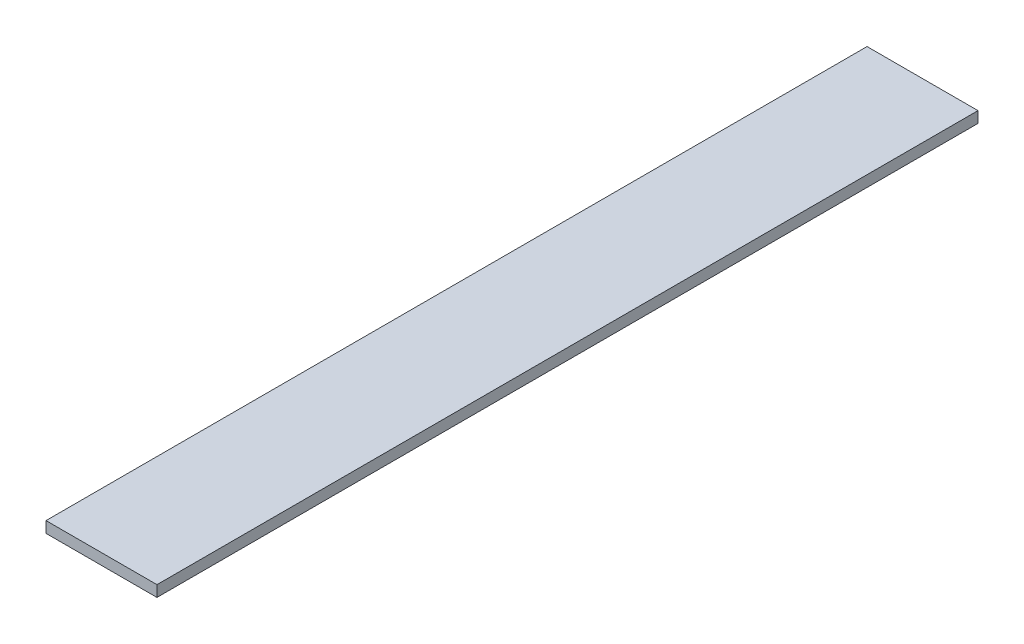
ISO-10303-21;
HEADER;
FILE_DESCRIPTION(('STEP AP214'),'2;1');
FILE_NAME('part.step','',(''),(''),'','','');
FILE_SCHEMA(('AUTOMOTIVE_DESIGN { 1 0 10303 214 1 1 1 1 }'));
ENDSEC;
DATA;
#1=APPLICATION_CONTEXT('core data for automotive mechanical design processes');
#2=APPLICATION_PROTOCOL_DEFINITION('international standard','automotive_design',2000,#1);
#3=PRODUCT_CONTEXT('',#1,'mechanical');
#4=PRODUCT('Part','Part','',(#3));
#5=PRODUCT_RELATED_PRODUCT_CATEGORY('part','',(#4));
#6=PRODUCT_DEFINITION_FORMATION('','',#4);
#7=PRODUCT_DEFINITION_CONTEXT('part definition',#1,'design');
#8=PRODUCT_DEFINITION('design','',#6,#7);
#9=PRODUCT_DEFINITION_SHAPE('','',#8);
#10=(LENGTH_UNIT() NAMED_UNIT(*) SI_UNIT(.MILLI.,.METRE.));
#11=(NAMED_UNIT(*) PLANE_ANGLE_UNIT() SI_UNIT($,.RADIAN.));
#12=(NAMED_UNIT(*) SI_UNIT($,.STERADIAN.) SOLID_ANGLE_UNIT());
#13=UNCERTAINTY_MEASURE_WITH_UNIT(LENGTH_MEASURE(1.E-05),#10,'distance_accuracy_value','');
#14=(GEOMETRIC_REPRESENTATION_CONTEXT(3) GLOBAL_UNCERTAINTY_ASSIGNED_CONTEXT((#13)) GLOBAL_UNIT_ASSIGNED_CONTEXT((#10,
#11,#12)) REPRESENTATION_CONTEXT('',''));
#15=CARTESIAN_POINT('',(0.,0.,0.));
#16=DIRECTION('',(0.,0.,1.));
#17=DIRECTION('',(1.,0.,0.));
#18=AXIS2_PLACEMENT_3D('',#15,#16,#17);
#19=CARTESIAN_POINT('',(0.,5.,-370.));
#20=DIRECTION('',(-1.,0.,0.));
#21=DIRECTION('',(0.,0.,1.));
#22=AXIS2_PLACEMENT_3D('',#19,#20,#21);
#23=PLANE('',#22);
#24=DIRECTION('',(0.,0.,-1.));
#25=VECTOR('',#24,1.);
#26=CARTESIAN_POINT('',(0.,0.,-370.));
#27=LINE('',#26,#25);
#28=CARTESIAN_POINT('',(0.,0.,0.));
#29=VERTEX_POINT('',#28);
#30=CARTESIAN_POINT('',(0.,0.,-370.));
#31=VERTEX_POINT('',#30);
#32=EDGE_CURVE('E107',#29,#31,#27,.T.);
#33=ORIENTED_EDGE('',*,*,#32,.T.);
#34=DIRECTION('',(0.,-1.,0.));
#35=VECTOR('',#34,1.);
#36=CARTESIAN_POINT('',(0.,5.,-370.));
#37=LINE('',#36,#35);
#38=CARTESIAN_POINT('',(0.,5.,-370.));
#39=VERTEX_POINT('',#38);
#40=EDGE_CURVE('E11',#39,#31,#37,.T.);
#41=ORIENTED_EDGE('',*,*,#40,.F.);
#42=DIRECTION('',(0.,0.,-1.));
#43=VECTOR('',#42,1.);
#44=CARTESIAN_POINT('',(0.,5.,-370.));
#45=LINE('',#44,#43);
#46=CARTESIAN_POINT('',(0.,5.,0.));
#47=VERTEX_POINT('',#46);
#48=EDGE_CURVE('E91',#47,#39,#45,.T.);
#49=ORIENTED_EDGE('',*,*,#48,.F.);
#50=DIRECTION('',(0.,-1.,0.));
#51=VECTOR('',#50,1.);
#52=CARTESIAN_POINT('',(0.,5.,0.));
#53=LINE('',#52,#51);
#54=EDGE_CURVE('E103',#47,#29,#53,.T.);
#55=ORIENTED_EDGE('',*,*,#54,.T.);
#56=EDGE_LOOP('',(#33,#41,#49,#55));
#57=FACE_BOUND('',#56,.T.);
#58=ADVANCED_FACE('F39',(#57),#23,.F.);
#59=CARTESIAN_POINT('',(-50.,5.,-370.));
#60=DIRECTION('',(0.,0.,1.));
#61=DIRECTION('',(1.,0.,0.));
#62=AXIS2_PLACEMENT_3D('',#59,#60,#61);
#63=PLANE('',#62);
#64=DIRECTION('',(-1.,0.,0.));
#65=VECTOR('',#64,1.);
#66=CARTESIAN_POINT('',(-50.,0.,-370.));
#67=LINE('',#66,#65);
#68=CARTESIAN_POINT('',(-50.,0.,-370.));
#69=VERTEX_POINT('',#68);
#70=EDGE_CURVE('E96',#31,#69,#67,.T.);
#71=ORIENTED_EDGE('',*,*,#70,.T.);
#72=DIRECTION('',(0.,-1.,0.));
#73=VECTOR('',#72,1.);
#74=CARTESIAN_POINT('',(-50.,5.,-370.));
#75=LINE('',#74,#73);
#76=CARTESIAN_POINT('',(-50.,5.,-370.));
#77=VERTEX_POINT('',#76);
#78=EDGE_CURVE('E48',#77,#69,#75,.T.);
#79=ORIENTED_EDGE('',*,*,#78,.F.);
#80=DIRECTION('',(-1.,0.,0.));
#81=VECTOR('',#80,1.);
#82=CARTESIAN_POINT('',(-50.,5.,-370.));
#83=LINE('',#82,#81);
#84=EDGE_CURVE('E86',#39,#77,#83,.T.);
#85=ORIENTED_EDGE('',*,*,#84,.F.);
#86=ORIENTED_EDGE('',*,*,#40,.T.);
#87=EDGE_LOOP('',(#71,#79,#85,#86));
#88=FACE_BOUND('',#87,.T.);
#89=ADVANCED_FACE('F95',(#88),#63,.F.);
#90=CARTESIAN_POINT('',(-50.,5.,0.));
#91=DIRECTION('',(1.,0.,0.));
#92=DIRECTION('',(0.,0.,-1.));
#93=AXIS2_PLACEMENT_3D('',#90,#91,#92);
#94=PLANE('',#93);
#95=DIRECTION('',(0.,0.,1.));
#96=VECTOR('',#95,1.);
#97=CARTESIAN_POINT('',(-50.,0.,0.));
#98=LINE('',#97,#96);
#99=CARTESIAN_POINT('',(-50.,0.,0.));
#100=VERTEX_POINT('',#99);
#101=EDGE_CURVE('E73',#69,#100,#98,.T.);
#102=ORIENTED_EDGE('',*,*,#101,.T.);
#103=DIRECTION('',(0.,-1.,0.));
#104=VECTOR('',#103,1.);
#105=CARTESIAN_POINT('',(-50.,5.,0.));
#106=LINE('',#105,#104);
#107=CARTESIAN_POINT('',(-50.,5.,0.));
#108=VERTEX_POINT('',#107);
#109=EDGE_CURVE('E98',#108,#100,#106,.T.);
#110=ORIENTED_EDGE('',*,*,#109,.F.);
#111=DIRECTION('',(0.,0.,1.));
#112=VECTOR('',#111,1.);
#113=CARTESIAN_POINT('',(-50.,5.,0.));
#114=LINE('',#113,#112);
#115=EDGE_CURVE('E89',#77,#108,#114,.T.);
#116=ORIENTED_EDGE('',*,*,#115,.F.);
#117=ORIENTED_EDGE('',*,*,#78,.T.);
#118=EDGE_LOOP('',(#102,#110,#116,#117));
#119=FACE_BOUND('',#118,.T.);
#120=ADVANCED_FACE('F99',(#119),#94,.F.);
#121=CARTESIAN_POINT('',(0.,5.,0.));
#122=DIRECTION('',(0.,0.,-1.));
#123=DIRECTION('',(-1.,0.,0.));
#124=AXIS2_PLACEMENT_3D('',#121,#122,#123);
#125=PLANE('',#124);
#126=DIRECTION('',(1.,0.,0.));
#127=VECTOR('',#126,1.);
#128=CARTESIAN_POINT('',(0.,0.,0.));
#129=LINE('',#128,#127);
#130=EDGE_CURVE('E79',#100,#29,#129,.T.);
#131=ORIENTED_EDGE('',*,*,#130,.T.);
#132=ORIENTED_EDGE('',*,*,#54,.F.);
#133=DIRECTION('',(1.,0.,0.));
#134=VECTOR('',#133,1.);
#135=CARTESIAN_POINT('',(0.,5.,0.));
#136=LINE('',#135,#134);
#137=EDGE_CURVE('E56',#108,#47,#136,.T.);
#138=ORIENTED_EDGE('',*,*,#137,.F.);
#139=ORIENTED_EDGE('',*,*,#109,.T.);
#140=EDGE_LOOP('',(#131,#132,#138,#139));
#141=FACE_BOUND('',#140,.T.);
#142=ADVANCED_FACE('F120',(#141),#125,.F.);
#143=CARTESIAN_POINT('',(0.,5.,0.));
#144=DIRECTION('',(0.,-1.,0.));
#145=DIRECTION('',(0.,0.,-1.));
#146=AXIS2_PLACEMENT_3D('',#143,#144,#145);
#147=PLANE('',#146);
#148=ORIENTED_EDGE('',*,*,#48,.T.);
#149=ORIENTED_EDGE('',*,*,#84,.T.);
#150=ORIENTED_EDGE('',*,*,#115,.T.);
#151=ORIENTED_EDGE('',*,*,#137,.T.);
#152=EDGE_LOOP('',(#148,#149,#150,#151));
#153=FACE_BOUND('',#152,.T.);
#154=ADVANCED_FACE('F87',(#153),#147,.F.);
#155=CARTESIAN_POINT('',(0.,0.,0.));
#156=DIRECTION('',(0.,-1.,0.));
#157=DIRECTION('',(0.,0.,-1.));
#158=AXIS2_PLACEMENT_3D('',#155,#156,#157);
#159=PLANE('',#158);
#160=ORIENTED_EDGE('',*,*,#32,.F.);
#161=ORIENTED_EDGE('',*,*,#130,.F.);
#162=ORIENTED_EDGE('',*,*,#101,.F.);
#163=ORIENTED_EDGE('',*,*,#70,.F.);
#164=EDGE_LOOP('',(#160,#161,#162,#163));
#165=FACE_BOUND('',#164,.T.);
#166=ADVANCED_FACE('F123',(#165),#159,.T.);
#167=CLOSED_SHELL('',(#58,#89,#120,#142,#154,#166));
#168=MANIFOLD_SOLID_BREP('B2',#167);
#169=ADVANCED_BREP_SHAPE_REPRESENTATION('',(#18,#168),#14);
#170=SHAPE_DEFINITION_REPRESENTATION(#9,#169);
ENDSEC;
END-ISO-10303-21;
